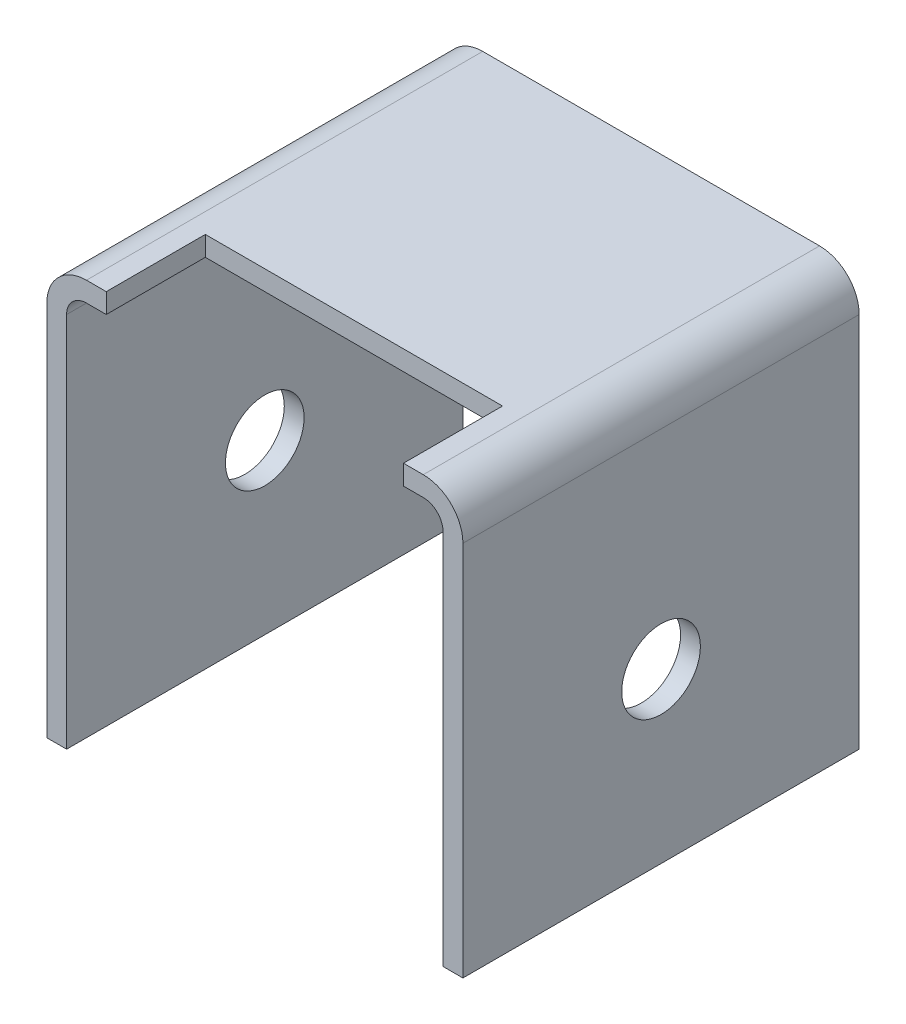
ISO-10303-21;
HEADER;
FILE_DESCRIPTION(('STEP AP214'),'2;1');
FILE_NAME('part.step','',(''),(''),'','','');
FILE_SCHEMA(('AUTOMOTIVE_DESIGN { 1 0 10303 214 1 1 1 1 }'));
ENDSEC;
DATA;
#1=APPLICATION_CONTEXT('core data for automotive mechanical design processes');
#2=APPLICATION_PROTOCOL_DEFINITION('international standard','automotive_design',2000,#1);
#3=PRODUCT_CONTEXT('',#1,'mechanical');
#4=PRODUCT('Part','Part','',(#3));
#5=PRODUCT_RELATED_PRODUCT_CATEGORY('part','',(#4));
#6=PRODUCT_DEFINITION_FORMATION('','',#4);
#7=PRODUCT_DEFINITION_CONTEXT('part definition',#1,'design');
#8=PRODUCT_DEFINITION('design','',#6,#7);
#9=PRODUCT_DEFINITION_SHAPE('','',#8);
#10=(LENGTH_UNIT() NAMED_UNIT(*) SI_UNIT(.MILLI.,.METRE.));
#11=(NAMED_UNIT(*) PLANE_ANGLE_UNIT() SI_UNIT($,.RADIAN.));
#12=(NAMED_UNIT(*) SI_UNIT($,.STERADIAN.) SOLID_ANGLE_UNIT());
#13=UNCERTAINTY_MEASURE_WITH_UNIT(LENGTH_MEASURE(1.E-05),#10,'distance_accuracy_value','');
#14=(GEOMETRIC_REPRESENTATION_CONTEXT(3) GLOBAL_UNCERTAINTY_ASSIGNED_CONTEXT((#13)) GLOBAL_UNIT_ASSIGNED_CONTEXT((#10,
#11,#12)) REPRESENTATION_CONTEXT('',''));
#15=CARTESIAN_POINT('',(0.,0.,0.));
#16=DIRECTION('',(0.,0.,1.));
#17=DIRECTION('',(1.,0.,0.));
#18=AXIS2_PLACEMENT_3D('',#15,#16,#17);
#19=CARTESIAN_POINT('',(21.59,-5.08,25.4));
#20=DIRECTION('',(0.,0.,-1.));
#21=DIRECTION('',(-1.,0.,0.));
#22=AXIS2_PLACEMENT_3D('',#19,#20,#21);
#23=PLANE('',#22);
#24=DIRECTION('',(1.,0.,0.));
#25=VECTOR('',#24,1.);
#26=CARTESIAN_POINT('',(-21.59,0.,25.4));
#27=LINE('',#26,#25);
#28=CARTESIAN_POINT('',(19.05,0.,25.4));
#29=VERTEX_POINT('',#28);
#30=CARTESIAN_POINT('',(21.59,0.,25.4));
#31=VERTEX_POINT('',#30);
#32=EDGE_CURVE('E243',#29,#31,#27,.T.);
#33=ORIENTED_EDGE('',*,*,#32,.F.);
#34=DIRECTION('',(0.,-1.,0.));
#35=VECTOR('',#34,1.);
#36=CARTESIAN_POINT('',(19.05,0.,25.4));
#37=LINE('',#36,#35);
#38=CARTESIAN_POINT('',(19.05,-2.53999999999999,25.4));
#39=VERTEX_POINT('',#38);
#40=EDGE_CURVE('E421',#29,#39,#37,.T.);
#41=ORIENTED_EDGE('',*,*,#40,.T.);
#42=DIRECTION('',(1.,0.,0.));
#43=VECTOR('',#42,1.);
#44=CARTESIAN_POINT('',(-21.59,-2.54,25.4));
#45=LINE('',#44,#43);
#46=CARTESIAN_POINT('',(21.59,-2.54,25.4));
#47=VERTEX_POINT('',#46);
#48=EDGE_CURVE('E151',#39,#47,#45,.T.);
#49=ORIENTED_EDGE('',*,*,#48,.T.);
#50=CARTESIAN_POINT('',(21.59,-5.08,25.4));
#51=DIRECTION('',(0.,0.,1.));
#52=DIRECTION('',(1.,0.,0.));
#53=AXIS2_PLACEMENT_3D('',#50,#51,#52);
#54=CIRCLE('',#53,2.54);
#55=CARTESIAN_POINT('',(24.13,-5.08,25.4));
#56=VERTEX_POINT('',#55);
#57=EDGE_CURVE('E57',#47,#56,#54,.F.);
#58=ORIENTED_EDGE('',*,*,#57,.T.);
#59=DIRECTION('',(0.,-1.,0.));
#60=VECTOR('',#59,1.);
#61=CARTESIAN_POINT('',(24.13,-5.08,25.4));
#62=LINE('',#61,#60);
#63=CARTESIAN_POINT('',(24.13,-53.34,25.4));
#64=VERTEX_POINT('',#63);
#65=EDGE_CURVE('E107',#56,#64,#62,.T.);
#66=ORIENTED_EDGE('',*,*,#65,.T.);
#67=DIRECTION('',(-1.,0.,0.));
#68=VECTOR('',#67,1.);
#69=CARTESIAN_POINT('',(26.67,-53.34,25.4));
#70=LINE('',#69,#68);
#71=CARTESIAN_POINT('',(26.67,-53.34,25.4));
#72=VERTEX_POINT('',#71);
#73=EDGE_CURVE('E241',#72,#64,#70,.T.);
#74=ORIENTED_EDGE('',*,*,#73,.F.);
#75=DIRECTION('',(0.,-1.,0.));
#76=VECTOR('',#75,1.);
#77=CARTESIAN_POINT('',(26.67,-5.08,25.4));
#78=LINE('',#77,#76);
#79=CARTESIAN_POINT('',(26.67,-5.08,25.4));
#80=VERTEX_POINT('',#79);
#81=EDGE_CURVE('E225',#80,#72,#78,.T.);
#82=ORIENTED_EDGE('',*,*,#81,.F.);
#83=CARTESIAN_POINT('',(21.59,-5.08,25.4));
#84=DIRECTION('',(0.,0.,-1.));
#85=DIRECTION('',(-1.,0.,0.));
#86=AXIS2_PLACEMENT_3D('',#83,#84,#85);
#87=CIRCLE('',#86,5.08);
#88=EDGE_CURVE('E239',#31,#80,#87,.T.);
#89=ORIENTED_EDGE('',*,*,#88,.F.);
#90=EDGE_LOOP('',(#33,#41,#49,#58,#66,#74,#82,#89));
#91=FACE_BOUND('',#90,.T.);
#92=ADVANCED_FACE('F33',(#91),#23,.F.);
#93=CARTESIAN_POINT('',(24.13,-5.08,25.4));
#94=DIRECTION('',(1.,0.,0.));
#95=DIRECTION('',(0.,1.,0.));
#96=AXIS2_PLACEMENT_3D('',#93,#94,#95);
#97=PLANE('',#96);
#98=CARTESIAN_POINT('',(24.13,-31.75,0.));
#99=DIRECTION('',(1.,0.,0.));
#100=DIRECTION('',(0.,1.,0.));
#101=AXIS2_PLACEMENT_3D('',#98,#99,#100);
#102=CIRCLE('',#101,5.04189999999999);
#103=CARTESIAN_POINT('',(24.13,-26.7081,0.));
#104=VERTEX_POINT('',#103);
#105=EDGE_CURVE('E461',#104,#104,#102,.T.);
#106=ORIENTED_EDGE('',*,*,#105,.T.);
#107=EDGE_LOOP('',(#106));
#108=FACE_BOUND('',#107,.T.);
#109=DIRECTION('',(0.,-1.,0.));
#110=VECTOR('',#109,1.);
#111=CARTESIAN_POINT('',(24.13,-5.08,-25.4));
#112=LINE('',#111,#110);
#113=CARTESIAN_POINT('',(24.13,-5.08,-25.4));
#114=VERTEX_POINT('',#113);
#115=CARTESIAN_POINT('',(24.13,-53.34,-25.4));
#116=VERTEX_POINT('',#115);
#117=EDGE_CURVE('E174',#114,#116,#112,.T.);
#118=ORIENTED_EDGE('',*,*,#117,.T.);
#119=DIRECTION('',(0.,0.,-1.));
#120=VECTOR('',#119,1.);
#121=CARTESIAN_POINT('',(24.13,-53.34,25.4));
#122=LINE('',#121,#120);
#123=EDGE_CURVE('E11',#64,#116,#122,.T.);
#124=ORIENTED_EDGE('',*,*,#123,.F.);
#125=ORIENTED_EDGE('',*,*,#65,.F.);
#126=DIRECTION('',(0.,0.,-1.));
#127=VECTOR('',#126,1.);
#128=CARTESIAN_POINT('',(24.13,-5.08,25.4));
#129=LINE('',#128,#127);
#130=EDGE_CURVE('E170',#56,#114,#129,.T.);
#131=ORIENTED_EDGE('',*,*,#130,.T.);
#132=EDGE_LOOP('',(#118,#124,#125,#131));
#133=FACE_BOUND('',#132,.T.);
#134=ADVANCED_FACE('F35',(#108,#133),#97,.F.);
#135=CARTESIAN_POINT('',(26.67,-53.34,25.4));
#136=DIRECTION('',(0.,-1.,0.));
#137=DIRECTION('',(0.,0.,-1.));
#138=AXIS2_PLACEMENT_3D('',#135,#136,#137);
#139=PLANE('',#138);
#140=DIRECTION('',(-1.,0.,0.));
#141=VECTOR('',#140,1.);
#142=CARTESIAN_POINT('',(26.67,-53.34,-25.4));
#143=LINE('',#142,#141);
#144=CARTESIAN_POINT('',(26.67,-53.34,-25.4));
#145=VERTEX_POINT('',#144);
#146=EDGE_CURVE('E177',#145,#116,#143,.T.);
#147=ORIENTED_EDGE('',*,*,#146,.F.);
#148=DIRECTION('',(0.,0.,-1.));
#149=VECTOR('',#148,1.);
#150=CARTESIAN_POINT('',(26.67,-53.34,25.4));
#151=LINE('',#150,#149);
#152=EDGE_CURVE('E41',#72,#145,#151,.T.);
#153=ORIENTED_EDGE('',*,*,#152,.F.);
#154=ORIENTED_EDGE('',*,*,#73,.T.);
#155=ORIENTED_EDGE('',*,*,#123,.T.);
#156=EDGE_LOOP('',(#147,#153,#154,#155));
#157=FACE_BOUND('',#156,.T.);
#158=ADVANCED_FACE('F228',(#157),#139,.T.);
#159=CARTESIAN_POINT('',(26.67,-5.08,25.4));
#160=DIRECTION('',(1.,0.,0.));
#161=DIRECTION('',(0.,1.,0.));
#162=AXIS2_PLACEMENT_3D('',#159,#160,#161);
#163=PLANE('',#162);
#164=CARTESIAN_POINT('',(26.67,-31.75,0.));
#165=DIRECTION('',(1.,0.,0.));
#166=DIRECTION('',(0.,0.,-1.));
#167=AXIS2_PLACEMENT_3D('',#164,#165,#166);
#168=CIRCLE('',#167,5.04189999999999);
#169=CARTESIAN_POINT('',(26.67,-31.75,-5.04189999999999));
#170=VERTEX_POINT('',#169);
#171=EDGE_CURVE('E452',#170,#170,#168,.T.);
#172=ORIENTED_EDGE('',*,*,#171,.F.);
#173=EDGE_LOOP('',(#172));
#174=FACE_BOUND('',#173,.T.);
#175=DIRECTION('',(0.,-1.,0.));
#176=VECTOR('',#175,1.);
#177=CARTESIAN_POINT('',(26.67,-5.08,-25.4));
#178=LINE('',#177,#176);
#179=CARTESIAN_POINT('',(26.67,-5.08,-25.4));
#180=VERTEX_POINT('',#179);
#181=EDGE_CURVE('E181',#180,#145,#178,.T.);
#182=ORIENTED_EDGE('',*,*,#181,.F.);
#183=DIRECTION('',(0.,0.,-1.));
#184=VECTOR('',#183,1.);
#185=CARTESIAN_POINT('',(26.67,-5.08,25.4));
#186=LINE('',#185,#184);
#187=EDGE_CURVE('E218',#80,#180,#186,.T.);
#188=ORIENTED_EDGE('',*,*,#187,.F.);
#189=ORIENTED_EDGE('',*,*,#81,.T.);
#190=ORIENTED_EDGE('',*,*,#152,.T.);
#191=EDGE_LOOP('',(#182,#188,#189,#190));
#192=FACE_BOUND('',#191,.T.);
#193=ADVANCED_FACE('F223',(#174,#192),#163,.T.);
#194=CARTESIAN_POINT('',(21.59,-5.08,25.4));
#195=DIRECTION('',(0.,0.,-1.));
#196=DIRECTION('',(-1.,0.,0.));
#197=AXIS2_PLACEMENT_3D('',#194,#195,#196);
#198=CYLINDRICAL_SURFACE('',#197,5.08);
#199=CARTESIAN_POINT('',(21.59,-5.08,-25.4));
#200=DIRECTION('',(0.,0.,-1.));
#201=DIRECTION('',(-1.,0.,0.));
#202=AXIS2_PLACEMENT_3D('',#199,#200,#201);
#203=CIRCLE('',#202,5.08);
#204=CARTESIAN_POINT('',(21.59,0.,-25.4));
#205=VERTEX_POINT('',#204);
#206=EDGE_CURVE('E184',#205,#180,#203,.T.);
#207=ORIENTED_EDGE('',*,*,#206,.F.);
#208=DIRECTION('',(0.,0.,-1.));
#209=VECTOR('',#208,1.);
#210=CARTESIAN_POINT('',(21.59,0.,25.4));
#211=LINE('',#210,#209);
#212=EDGE_CURVE('E216',#31,#205,#211,.T.);
#213=ORIENTED_EDGE('',*,*,#212,.F.);
#214=ORIENTED_EDGE('',*,*,#88,.T.);
#215=ORIENTED_EDGE('',*,*,#187,.T.);
#216=EDGE_LOOP('',(#207,#213,#214,#215));
#217=FACE_BOUND('',#216,.T.);
#218=ADVANCED_FACE('F236',(#217),#198,.T.);
#219=CARTESIAN_POINT('',(-21.59,0.,25.4));
#220=DIRECTION('',(0.,1.,0.));
#221=DIRECTION('',(-1.,0.,0.));
#222=AXIS2_PLACEMENT_3D('',#219,#220,#221);
#223=PLANE('',#222);
#224=DIRECTION('',(0.,0.,1.));
#225=VECTOR('',#224,1.);
#226=CARTESIAN_POINT('',(19.05,0.,25.4));
#227=LINE('',#226,#225);
#228=CARTESIAN_POINT('',(19.05,0.,12.7));
#229=VERTEX_POINT('',#228);
#230=EDGE_CURVE('E417',#229,#29,#227,.T.);
#231=ORIENTED_EDGE('',*,*,#230,.T.);
#232=ORIENTED_EDGE('',*,*,#32,.T.);
#233=ORIENTED_EDGE('',*,*,#212,.T.);
#234=DIRECTION('',(1.,0.,0.));
#235=VECTOR('',#234,1.);
#236=CARTESIAN_POINT('',(-21.59,0.,-25.4));
#237=LINE('',#236,#235);
#238=CARTESIAN_POINT('',(-21.59,0.,-25.4));
#239=VERTEX_POINT('',#238);
#240=EDGE_CURVE('E187',#239,#205,#237,.T.);
#241=ORIENTED_EDGE('',*,*,#240,.F.);
#242=DIRECTION('',(0.,0.,-1.));
#243=VECTOR('',#242,1.);
#244=CARTESIAN_POINT('',(-21.59,0.,25.4));
#245=LINE('',#244,#243);
#246=CARTESIAN_POINT('',(-21.59,0.,25.4));
#247=VERTEX_POINT('',#246);
#248=EDGE_CURVE('E214',#247,#239,#245,.T.);
#249=ORIENTED_EDGE('',*,*,#248,.F.);
#250=CARTESIAN_POINT('',(-19.05,0.,25.4));
#251=VERTEX_POINT('',#250);
#252=EDGE_CURVE('E248',#247,#251,#27,.T.);
#253=ORIENTED_EDGE('',*,*,#252,.T.);
#254=DIRECTION('',(0.,0.,-1.));
#255=VECTOR('',#254,1.);
#256=CARTESIAN_POINT('',(-19.05,0.,25.4));
#257=LINE('',#256,#255);
#258=CARTESIAN_POINT('',(-19.05,0.,12.7));
#259=VERTEX_POINT('',#258);
#260=EDGE_CURVE('E48',#251,#259,#257,.T.);
#261=ORIENTED_EDGE('',*,*,#260,.T.);
#262=DIRECTION('',(1.,0.,0.));
#263=VECTOR('',#262,1.);
#264=CARTESIAN_POINT('',(19.05,0.,12.7));
#265=LINE('',#264,#263);
#266=EDGE_CURVE('E441',#259,#229,#265,.T.);
#267=ORIENTED_EDGE('',*,*,#266,.T.);
#268=EDGE_LOOP('',(#231,#232,#233,#241,#249,#253,#261,#267));
#269=FACE_BOUND('',#268,.T.);
#270=ADVANCED_FACE('F387',(#269),#223,.T.);
#271=CARTESIAN_POINT('',(-21.59,-5.08000000000001,25.4));
#272=DIRECTION('',(0.,0.,-1.));
#273=DIRECTION('',(-1.,0.,0.));
#274=AXIS2_PLACEMENT_3D('',#271,#272,#273);
#275=CYLINDRICAL_SURFACE('',#274,5.08);
#276=CARTESIAN_POINT('',(-21.59,-5.08000000000001,-25.4));
#277=DIRECTION('',(0.,0.,-1.));
#278=DIRECTION('',(-1.,0.,0.));
#279=AXIS2_PLACEMENT_3D('',#276,#277,#278);
#280=CIRCLE('',#279,5.08);
#281=CARTESIAN_POINT('',(-26.67,-5.08000000000001,-25.4));
#282=VERTEX_POINT('',#281);
#283=EDGE_CURVE('E190',#282,#239,#280,.T.);
#284=ORIENTED_EDGE('',*,*,#283,.F.);
#285=DIRECTION('',(0.,0.,-1.));
#286=VECTOR('',#285,1.);
#287=CARTESIAN_POINT('',(-26.67,-5.08000000000001,25.4));
#288=LINE('',#287,#286);
#289=CARTESIAN_POINT('',(-26.67,-5.08000000000001,25.4));
#290=VERTEX_POINT('',#289);
#291=EDGE_CURVE('E212',#290,#282,#288,.T.);
#292=ORIENTED_EDGE('',*,*,#291,.F.);
#293=CARTESIAN_POINT('',(-21.59,-5.08000000000001,25.4));
#294=DIRECTION('',(0.,0.,-1.));
#295=DIRECTION('',(-1.,0.,0.));
#296=AXIS2_PLACEMENT_3D('',#293,#294,#295);
#297=CIRCLE('',#296,5.08);
#298=EDGE_CURVE('E251',#290,#247,#297,.T.);
#299=ORIENTED_EDGE('',*,*,#298,.T.);
#300=ORIENTED_EDGE('',*,*,#248,.T.);
#301=EDGE_LOOP('',(#284,#292,#299,#300));
#302=FACE_BOUND('',#301,.T.);
#303=ADVANCED_FACE('F354',(#302),#275,.T.);
#304=CARTESIAN_POINT('',(-26.67,-53.34,25.4));
#305=DIRECTION('',(-1.,0.,0.));
#306=DIRECTION('',(0.,-1.,0.));
#307=AXIS2_PLACEMENT_3D('',#304,#305,#306);
#308=PLANE('',#307);
#309=CARTESIAN_POINT('',(-26.67,-31.75,0.));
#310=DIRECTION('',(1.,0.,0.));
#311=DIRECTION('',(0.,0.,-1.));
#312=AXIS2_PLACEMENT_3D('',#309,#310,#311);
#313=CIRCLE('',#312,5.04189999999998);
#314=CARTESIAN_POINT('',(-26.67,-31.75,-5.04189999999998));
#315=VERTEX_POINT('',#314);
#316=EDGE_CURVE('E458',#315,#315,#313,.T.);
#317=ORIENTED_EDGE('',*,*,#316,.T.);
#318=EDGE_LOOP('',(#317));
#319=FACE_BOUND('',#318,.T.);
#320=DIRECTION('',(0.,1.,0.));
#321=VECTOR('',#320,1.);
#322=CARTESIAN_POINT('',(-26.67,-53.34,-25.4));
#323=LINE('',#322,#321);
#324=CARTESIAN_POINT('',(-26.67,-53.34,-25.4));
#325=VERTEX_POINT('',#324);
#326=EDGE_CURVE('E193',#325,#282,#323,.T.);
#327=ORIENTED_EDGE('',*,*,#326,.F.);
#328=DIRECTION('',(0.,0.,-1.));
#329=VECTOR('',#328,1.);
#330=CARTESIAN_POINT('',(-26.67,-53.34,25.4));
#331=LINE('',#330,#329);
#332=CARTESIAN_POINT('',(-26.67,-53.34,25.4));
#333=VERTEX_POINT('',#332);
#334=EDGE_CURVE('E210',#333,#325,#331,.T.);
#335=ORIENTED_EDGE('',*,*,#334,.F.);
#336=DIRECTION('',(0.,1.,0.));
#337=VECTOR('',#336,1.);
#338=CARTESIAN_POINT('',(-26.67,-53.34,25.4));
#339=LINE('',#338,#337);
#340=EDGE_CURVE('E254',#333,#290,#339,.T.);
#341=ORIENTED_EDGE('',*,*,#340,.T.);
#342=ORIENTED_EDGE('',*,*,#291,.T.);
#343=EDGE_LOOP('',(#327,#335,#341,#342));
#344=FACE_BOUND('',#343,.T.);
#345=ADVANCED_FACE('F267',(#319,#344),#308,.T.);
#346=CARTESIAN_POINT('',(-24.13,-53.34,25.4));
#347=DIRECTION('',(0.,-1.,0.));
#348=DIRECTION('',(0.,0.,-1.));
#349=AXIS2_PLACEMENT_3D('',#346,#347,#348);
#350=PLANE('',#349);
#351=DIRECTION('',(-1.,0.,0.));
#352=VECTOR('',#351,1.);
#353=CARTESIAN_POINT('',(-24.13,-53.34,-25.4));
#354=LINE('',#353,#352);
#355=CARTESIAN_POINT('',(-24.13,-53.34,-25.4));
#356=VERTEX_POINT('',#355);
#357=EDGE_CURVE('E196',#356,#325,#354,.T.);
#358=ORIENTED_EDGE('',*,*,#357,.F.);
#359=DIRECTION('',(0.,0.,-1.));
#360=VECTOR('',#359,1.);
#361=CARTESIAN_POINT('',(-24.13,-53.34,25.4));
#362=LINE('',#361,#360);
#363=CARTESIAN_POINT('',(-24.13,-53.34,25.4));
#364=VERTEX_POINT('',#363);
#365=EDGE_CURVE('E208',#364,#356,#362,.T.);
#366=ORIENTED_EDGE('',*,*,#365,.F.);
#367=DIRECTION('',(-1.,0.,0.));
#368=VECTOR('',#367,1.);
#369=CARTESIAN_POINT('',(-24.13,-53.34,25.4));
#370=LINE('',#369,#368);
#371=EDGE_CURVE('E257',#364,#333,#370,.T.);
#372=ORIENTED_EDGE('',*,*,#371,.T.);
#373=ORIENTED_EDGE('',*,*,#334,.T.);
#374=EDGE_LOOP('',(#358,#366,#372,#373));
#375=FACE_BOUND('',#374,.T.);
#376=ADVANCED_FACE('F261',(#375),#350,.T.);
#377=CARTESIAN_POINT('',(-24.13,-53.34,25.4));
#378=DIRECTION('',(-1.,0.,0.));
#379=DIRECTION('',(0.,-1.,0.));
#380=AXIS2_PLACEMENT_3D('',#377,#378,#379);
#381=PLANE('',#380);
#382=CARTESIAN_POINT('',(-24.13,-31.75,0.));
#383=DIRECTION('',(-1.,0.,0.));
#384=DIRECTION('',(0.,-1.,0.));
#385=AXIS2_PLACEMENT_3D('',#382,#383,#384);
#386=CIRCLE('',#385,5.04189999999999);
#387=CARTESIAN_POINT('',(-24.13,-36.7919,0.));
#388=VERTEX_POINT('',#387);
#389=EDGE_CURVE('E178',#388,#388,#386,.T.);
#390=ORIENTED_EDGE('',*,*,#389,.T.);
#391=EDGE_LOOP('',(#390));
#392=FACE_BOUND('',#391,.T.);
#393=DIRECTION('',(0.,1.,0.));
#394=VECTOR('',#393,1.);
#395=CARTESIAN_POINT('',(-24.13,-53.34,-25.4));
#396=LINE('',#395,#394);
#397=CARTESIAN_POINT('',(-24.13,-5.08000000000001,-25.4));
#398=VERTEX_POINT('',#397);
#399=EDGE_CURVE('E199',#356,#398,#396,.T.);
#400=ORIENTED_EDGE('',*,*,#399,.T.);
#401=DIRECTION('',(0.,0.,-1.));
#402=VECTOR('',#401,1.);
#403=CARTESIAN_POINT('',(-24.13,-5.08000000000001,25.4));
#404=LINE('',#403,#402);
#405=CARTESIAN_POINT('',(-24.13,-5.08000000000001,25.4));
#406=VERTEX_POINT('',#405);
#407=EDGE_CURVE('E160',#406,#398,#404,.T.);
#408=ORIENTED_EDGE('',*,*,#407,.F.);
#409=DIRECTION('',(0.,1.,0.));
#410=VECTOR('',#409,1.);
#411=CARTESIAN_POINT('',(-24.13,-53.34,25.4));
#412=LINE('',#411,#410);
#413=EDGE_CURVE('E147',#364,#406,#412,.T.);
#414=ORIENTED_EDGE('',*,*,#413,.F.);
#415=ORIENTED_EDGE('',*,*,#365,.T.);
#416=EDGE_LOOP('',(#400,#408,#414,#415));
#417=FACE_BOUND('',#416,.T.);
#418=ADVANCED_FACE('F271',(#392,#417),#381,.F.);
#419=CARTESIAN_POINT('',(-21.59,-5.08000000000001,25.4));
#420=DIRECTION('',(0.,0.,-1.));
#421=DIRECTION('',(-1.,0.,0.));
#422=AXIS2_PLACEMENT_3D('',#419,#420,#421);
#423=CYLINDRICAL_SURFACE('',#422,2.54);
#424=CARTESIAN_POINT('',(-21.59,-5.08000000000001,-25.4));
#425=DIRECTION('',(0.,0.,1.));
#426=DIRECTION('',(1.,0.,0.));
#427=AXIS2_PLACEMENT_3D('',#424,#425,#426);
#428=CIRCLE('',#427,2.54);
#429=CARTESIAN_POINT('',(-21.59,-2.54,-25.4));
#430=VERTEX_POINT('',#429);
#431=EDGE_CURVE('E157',#398,#430,#428,.F.);
#432=ORIENTED_EDGE('',*,*,#431,.T.);
#433=DIRECTION('',(0.,0.,-1.));
#434=VECTOR('',#433,1.);
#435=CARTESIAN_POINT('',(-21.59,-2.54,25.4));
#436=LINE('',#435,#434);
#437=CARTESIAN_POINT('',(-21.59,-2.54,25.4));
#438=VERTEX_POINT('',#437);
#439=EDGE_CURVE('E154',#438,#430,#436,.T.);
#440=ORIENTED_EDGE('',*,*,#439,.F.);
#441=CARTESIAN_POINT('',(-21.59,-5.08000000000001,25.4));
#442=DIRECTION('',(0.,0.,1.));
#443=DIRECTION('',(1.,0.,0.));
#444=AXIS2_PLACEMENT_3D('',#441,#442,#443);
#445=CIRCLE('',#444,2.54);
#446=EDGE_CURVE('E139',#406,#438,#445,.F.);
#447=ORIENTED_EDGE('',*,*,#446,.F.);
#448=ORIENTED_EDGE('',*,*,#407,.T.);
#449=EDGE_LOOP('',(#432,#440,#447,#448));
#450=FACE_BOUND('',#449,.T.);
#451=ADVANCED_FACE('F155',(#450),#423,.F.);
#452=CARTESIAN_POINT('',(-21.59,-2.54,25.4));
#453=DIRECTION('',(0.,1.,0.));
#454=DIRECTION('',(-1.,0.,0.));
#455=AXIS2_PLACEMENT_3D('',#452,#453,#454);
#456=PLANE('',#455);
#457=ORIENTED_EDGE('',*,*,#48,.F.);
#458=DIRECTION('',(0.,0.,1.));
#459=VECTOR('',#458,1.);
#460=CARTESIAN_POINT('',(19.05,-2.53999999999999,25.4));
#461=LINE('',#460,#459);
#462=CARTESIAN_POINT('',(19.05,-2.53999999999999,12.7));
#463=VERTEX_POINT('',#462);
#464=EDGE_CURVE('E446',#463,#39,#461,.T.);
#465=ORIENTED_EDGE('',*,*,#464,.F.);
#466=DIRECTION('',(1.,0.,0.));
#467=VECTOR('',#466,1.);
#468=CARTESIAN_POINT('',(19.05,-2.53999999999999,12.7));
#469=LINE('',#468,#467);
#470=CARTESIAN_POINT('',(-19.05,-2.54,12.7));
#471=VERTEX_POINT('',#470);
#472=EDGE_CURVE('E439',#471,#463,#469,.T.);
#473=ORIENTED_EDGE('',*,*,#472,.F.);
#474=DIRECTION('',(0.,0.,-1.));
#475=VECTOR('',#474,1.);
#476=CARTESIAN_POINT('',(-19.05,-2.54,25.4));
#477=LINE('',#476,#475);
#478=CARTESIAN_POINT('',(-19.05,-2.54,25.4));
#479=VERTEX_POINT('',#478);
#480=EDGE_CURVE('E168',#479,#471,#477,.T.);
#481=ORIENTED_EDGE('',*,*,#480,.F.);
#482=EDGE_CURVE('E144',#438,#479,#45,.T.);
#483=ORIENTED_EDGE('',*,*,#482,.F.);
#484=ORIENTED_EDGE('',*,*,#439,.T.);
#485=DIRECTION('',(1.,0.,0.));
#486=VECTOR('',#485,1.);
#487=CARTESIAN_POINT('',(-21.59,-2.54,-25.4));
#488=LINE('',#487,#486);
#489=CARTESIAN_POINT('',(21.59,-2.54,-25.4));
#490=VERTEX_POINT('',#489);
#491=EDGE_CURVE('E202',#430,#490,#488,.T.);
#492=ORIENTED_EDGE('',*,*,#491,.T.);
#493=DIRECTION('',(0.,0.,-1.));
#494=VECTOR('',#493,1.);
#495=CARTESIAN_POINT('',(21.59,-2.54,25.4));
#496=LINE('',#495,#494);
#497=EDGE_CURVE('E161',#47,#490,#496,.T.);
#498=ORIENTED_EDGE('',*,*,#497,.F.);
#499=EDGE_LOOP('',(#457,#465,#473,#481,#483,#484,#492,#498));
#500=FACE_BOUND('',#499,.T.);
#501=ADVANCED_FACE('F165',(#500),#456,.F.);
#502=CARTESIAN_POINT('',(21.59,-5.08,25.4));
#503=DIRECTION('',(0.,0.,-1.));
#504=DIRECTION('',(-1.,0.,0.));
#505=AXIS2_PLACEMENT_3D('',#502,#503,#504);
#506=CYLINDRICAL_SURFACE('',#505,2.54);
#507=CARTESIAN_POINT('',(21.59,-5.08,-25.4));
#508=DIRECTION('',(0.,0.,1.));
#509=DIRECTION('',(1.,0.,0.));
#510=AXIS2_PLACEMENT_3D('',#507,#508,#509);
#511=CIRCLE('',#510,2.54);
#512=EDGE_CURVE('E101',#490,#114,#511,.F.);
#513=ORIENTED_EDGE('',*,*,#512,.T.);
#514=ORIENTED_EDGE('',*,*,#130,.F.);
#515=ORIENTED_EDGE('',*,*,#57,.F.);
#516=ORIENTED_EDGE('',*,*,#497,.T.);
#517=EDGE_LOOP('',(#513,#514,#515,#516));
#518=FACE_BOUND('',#517,.T.);
#519=ADVANCED_FACE('F291',(#518),#506,.F.);
#520=ORIENTED_EDGE('',*,*,#482,.T.);
#521=DIRECTION('',(0.,-1.,0.));
#522=VECTOR('',#521,1.);
#523=CARTESIAN_POINT('',(-19.05,0.,25.4));
#524=LINE('',#523,#522);
#525=EDGE_CURVE('E443',#251,#479,#524,.T.);
#526=ORIENTED_EDGE('',*,*,#525,.F.);
#527=ORIENTED_EDGE('',*,*,#252,.F.);
#528=ORIENTED_EDGE('',*,*,#298,.F.);
#529=ORIENTED_EDGE('',*,*,#340,.F.);
#530=ORIENTED_EDGE('',*,*,#371,.F.);
#531=ORIENTED_EDGE('',*,*,#413,.T.);
#532=ORIENTED_EDGE('',*,*,#446,.T.);
#533=EDGE_LOOP('',(#520,#526,#527,#528,#529,#530,#531,#532));
#534=FACE_BOUND('',#533,.T.);
#535=ADVANCED_FACE('F141',(#534),#23,.F.);
#536=CARTESIAN_POINT('',(21.59,-5.08,-25.4));
#537=DIRECTION('',(0.,0.,-1.));
#538=DIRECTION('',(-1.,0.,0.));
#539=AXIS2_PLACEMENT_3D('',#536,#537,#538);
#540=PLANE('',#539);
#541=ORIENTED_EDGE('',*,*,#117,.F.);
#542=ORIENTED_EDGE('',*,*,#512,.F.);
#543=ORIENTED_EDGE('',*,*,#491,.F.);
#544=ORIENTED_EDGE('',*,*,#431,.F.);
#545=ORIENTED_EDGE('',*,*,#399,.F.);
#546=ORIENTED_EDGE('',*,*,#357,.T.);
#547=ORIENTED_EDGE('',*,*,#326,.T.);
#548=ORIENTED_EDGE('',*,*,#283,.T.);
#549=ORIENTED_EDGE('',*,*,#240,.T.);
#550=ORIENTED_EDGE('',*,*,#206,.T.);
#551=ORIENTED_EDGE('',*,*,#181,.T.);
#552=ORIENTED_EDGE('',*,*,#146,.T.);
#553=EDGE_LOOP('',(#541,#542,#543,#544,#545,#546,#547,#548,#549,#550,#551,#552));
#554=FACE_BOUND('',#553,.T.);
#555=ADVANCED_FACE('F231',(#554),#540,.T.);
#556=CARTESIAN_POINT('',(26.67,-31.75,0.));
#557=DIRECTION('',(1.,0.,0.));
#558=DIRECTION('',(0.,0.,-1.));
#559=AXIS2_PLACEMENT_3D('',#556,#557,#558);
#560=CYLINDRICAL_SURFACE('',#559,5.04189999999999);
#561=ORIENTED_EDGE('',*,*,#171,.T.);
#562=EDGE_LOOP('',(#561));
#563=FACE_BOUND('',#562,.T.);
#564=ORIENTED_EDGE('',*,*,#105,.F.);
#565=EDGE_LOOP('',(#564));
#566=FACE_BOUND('',#565,.T.);
#567=ADVANCED_FACE('F296',(#563,#566),#560,.F.);
#568=ORIENTED_EDGE('',*,*,#316,.F.);
#569=EDGE_LOOP('',(#568));
#570=FACE_BOUND('',#569,.T.);
#571=ORIENTED_EDGE('',*,*,#389,.F.);
#572=EDGE_LOOP('',(#571));
#573=FACE_BOUND('',#572,.T.);
#574=ADVANCED_FACE('F368',(#570,#573),#560,.F.);
#575=CARTESIAN_POINT('',(19.05,0.,25.4));
#576=DIRECTION('',(1.,0.,0.));
#577=DIRECTION('',(0.,0.,-1.));
#578=AXIS2_PLACEMENT_3D('',#575,#576,#577);
#579=PLANE('',#578);
#580=ORIENTED_EDGE('',*,*,#464,.T.);
#581=ORIENTED_EDGE('',*,*,#40,.F.);
#582=ORIENTED_EDGE('',*,*,#230,.F.);
#583=DIRECTION('',(0.,-1.,0.));
#584=VECTOR('',#583,1.);
#585=CARTESIAN_POINT('',(19.05,0.,12.7));
#586=LINE('',#585,#584);
#587=EDGE_CURVE('E442',#229,#463,#586,.T.);
#588=ORIENTED_EDGE('',*,*,#587,.T.);
#589=EDGE_LOOP('',(#580,#581,#582,#588));
#590=FACE_BOUND('',#589,.T.);
#591=ADVANCED_FACE('F376',(#590),#579,.F.);
#592=CARTESIAN_POINT('',(19.05,0.,12.7));
#593=DIRECTION('',(0.,0.,-1.));
#594=DIRECTION('',(-1.,0.,0.));
#595=AXIS2_PLACEMENT_3D('',#592,#593,#594);
#596=PLANE('',#595);
#597=ORIENTED_EDGE('',*,*,#472,.T.);
#598=ORIENTED_EDGE('',*,*,#587,.F.);
#599=ORIENTED_EDGE('',*,*,#266,.F.);
#600=DIRECTION('',(0.,-1.,0.));
#601=VECTOR('',#600,1.);
#602=CARTESIAN_POINT('',(-19.05,0.,12.7));
#603=LINE('',#602,#601);
#604=EDGE_CURVE('E437',#259,#471,#603,.T.);
#605=ORIENTED_EDGE('',*,*,#604,.T.);
#606=EDGE_LOOP('',(#597,#598,#599,#605));
#607=FACE_BOUND('',#606,.T.);
#608=ADVANCED_FACE('F438',(#607),#596,.F.);
#609=CARTESIAN_POINT('',(-19.05,0.,25.4));
#610=DIRECTION('',(-1.,0.,0.));
#611=DIRECTION('',(0.,0.,1.));
#612=AXIS2_PLACEMENT_3D('',#609,#610,#611);
#613=PLANE('',#612);
#614=ORIENTED_EDGE('',*,*,#480,.T.);
#615=ORIENTED_EDGE('',*,*,#604,.F.);
#616=ORIENTED_EDGE('',*,*,#260,.F.);
#617=ORIENTED_EDGE('',*,*,#525,.T.);
#618=EDGE_LOOP('',(#614,#615,#616,#617));
#619=FACE_BOUND('',#618,.T.);
#620=ADVANCED_FACE('F445',(#619),#613,.F.);
#621=CLOSED_SHELL('',(#92,#134,#158,#193,#218,#270,#303,#345,#376,#418,#451,#501,#519,#535,#555,
#567,#574,#591,#608,#620));
#622=MANIFOLD_SOLID_BREP('B2',#621);
#623=ADVANCED_BREP_SHAPE_REPRESENTATION('',(#18,#622),#14);
#624=SHAPE_DEFINITION_REPRESENTATION(#9,#623);
ENDSEC;
END-ISO-10303-21;
